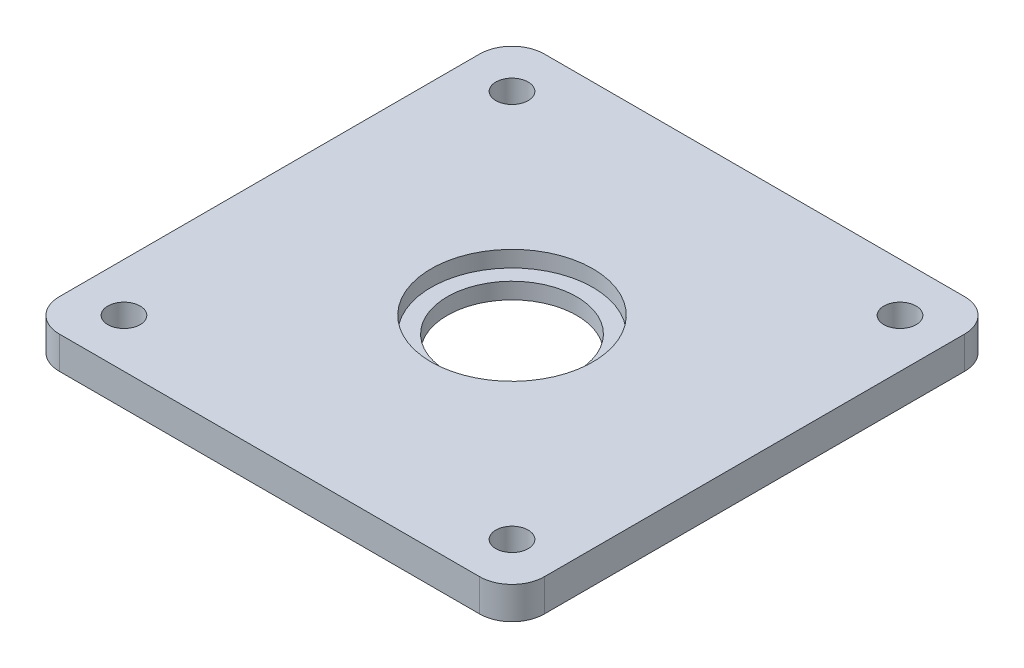
ISO-10303-21;
HEADER;
FILE_DESCRIPTION(('STEP AP214'),'2;1');
FILE_NAME('part.step','',(''),(''),'','','');
FILE_SCHEMA(('AUTOMOTIVE_DESIGN { 1 0 10303 214 1 1 1 1 }'));
ENDSEC;
DATA;
#1=APPLICATION_CONTEXT('core data for automotive mechanical design processes');
#2=APPLICATION_PROTOCOL_DEFINITION('international standard','automotive_design',2000,#1);
#3=PRODUCT_CONTEXT('',#1,'mechanical');
#4=PRODUCT('Part','Part','',(#3));
#5=PRODUCT_RELATED_PRODUCT_CATEGORY('part','',(#4));
#6=PRODUCT_DEFINITION_FORMATION('','',#4);
#7=PRODUCT_DEFINITION_CONTEXT('part definition',#1,'design');
#8=PRODUCT_DEFINITION('design','',#6,#7);
#9=PRODUCT_DEFINITION_SHAPE('','',#8);
#10=(LENGTH_UNIT() NAMED_UNIT(*) SI_UNIT(.MILLI.,.METRE.));
#11=(NAMED_UNIT(*) PLANE_ANGLE_UNIT() SI_UNIT($,.RADIAN.));
#12=(NAMED_UNIT(*) SI_UNIT($,.STERADIAN.) SOLID_ANGLE_UNIT());
#13=UNCERTAINTY_MEASURE_WITH_UNIT(LENGTH_MEASURE(1.E-05),#10,'distance_accuracy_value','');
#14=(GEOMETRIC_REPRESENTATION_CONTEXT(3) GLOBAL_UNCERTAINTY_ASSIGNED_CONTEXT((#13)) GLOBAL_UNIT_ASSIGNED_CONTEXT((#10,
#11,#12)) REPRESENTATION_CONTEXT('',''));
#15=CARTESIAN_POINT('',(0.,0.,0.));
#16=DIRECTION('',(0.,0.,1.));
#17=DIRECTION('',(1.,0.,0.));
#18=AXIS2_PLACEMENT_3D('',#15,#16,#17);
#19=CARTESIAN_POINT('',(0.,5.08,0.));
#20=DIRECTION('',(0.,-1.,0.));
#21=DIRECTION('',(0.,0.,-1.));
#22=AXIS2_PLACEMENT_3D('',#19,#20,#21);
#23=CYLINDRICAL_SURFACE('',#22,10.16);
#24=CARTESIAN_POINT('',(0.,0.,0.));
#25=DIRECTION('',(0.,1.,0.));
#26=DIRECTION('',(0.,0.,1.));
#27=AXIS2_PLACEMENT_3D('',#24,#25,#26);
#28=CIRCLE('',#27,10.16);
#29=CARTESIAN_POINT('',(0.,0.,10.16));
#30=VERTEX_POINT('',#29);
#31=EDGE_CURVE('E135',#30,#30,#28,.T.);
#32=ORIENTED_EDGE('',*,*,#31,.F.);
#33=EDGE_LOOP('',(#32));
#34=FACE_BOUND('',#33,.T.);
#35=CARTESIAN_POINT('',(0.,2.54,0.));
#36=DIRECTION('',(0.,1.,0.));
#37=DIRECTION('',(0.,0.,1.));
#38=AXIS2_PLACEMENT_3D('',#35,#36,#37);
#39=CIRCLE('',#38,10.16);
#40=CARTESIAN_POINT('',(0.,2.54,10.16));
#41=VERTEX_POINT('',#40);
#42=EDGE_CURVE('E36',#41,#41,#39,.T.);
#43=ORIENTED_EDGE('',*,*,#42,.T.);
#44=EDGE_LOOP('',(#43));
#45=FACE_BOUND('',#44,.T.);
#46=ADVANCED_FACE('F32',(#34,#45),#23,.F.);
#47=CARTESIAN_POINT('',(-33.02,5.08,33.02));
#48=DIRECTION('',(0.,-1.,0.));
#49=DIRECTION('',(0.,0.,-1.));
#50=AXIS2_PLACEMENT_3D('',#47,#48,#49);
#51=PLANE('',#50);
#52=CARTESIAN_POINT('',(0.,5.08,0.));
#53=DIRECTION('',(0.,1.,0.));
#54=DIRECTION('',(0.,0.,1.));
#55=AXIS2_PLACEMENT_3D('',#52,#53,#54);
#56=CIRCLE('',#55,12.7);
#57=CARTESIAN_POINT('',(0.,5.08,12.7));
#58=VERTEX_POINT('',#57);
#59=EDGE_CURVE('E207',#58,#58,#56,.T.);
#60=ORIENTED_EDGE('',*,*,#59,.F.);
#61=EDGE_LOOP('',(#60));
#62=FACE_BOUND('',#61,.T.);
#63=CARTESIAN_POINT('',(-33.02,5.08,33.02));
#64=DIRECTION('',(0.,1.,0.));
#65=DIRECTION('',(0.,0.,-1.));
#66=AXIS2_PLACEMENT_3D('',#63,#64,#65);
#67=CIRCLE('',#66,5.08);
#68=CARTESIAN_POINT('',(-38.1,5.08,33.02));
#69=VERTEX_POINT('',#68);
#70=CARTESIAN_POINT('',(-33.02,5.08,38.1));
#71=VERTEX_POINT('',#70);
#72=EDGE_CURVE('E146',#69,#71,#67,.T.);
#73=ORIENTED_EDGE('',*,*,#72,.T.);
#74=DIRECTION('',(1.,0.,0.));
#75=VECTOR('',#74,1.);
#76=CARTESIAN_POINT('',(-33.02,5.08,38.1));
#77=LINE('',#76,#75);
#78=CARTESIAN_POINT('',(33.02,5.08,38.1));
#79=VERTEX_POINT('',#78);
#80=EDGE_CURVE('E93',#71,#79,#77,.T.);
#81=ORIENTED_EDGE('',*,*,#80,.T.);
#82=CARTESIAN_POINT('',(33.02,5.08,33.02));
#83=DIRECTION('',(0.,1.,0.));
#84=DIRECTION('',(0.,0.,1.));
#85=AXIS2_PLACEMENT_3D('',#82,#83,#84);
#86=CIRCLE('',#85,5.08);
#87=CARTESIAN_POINT('',(38.1,5.08,33.02));
#88=VERTEX_POINT('',#87);
#89=EDGE_CURVE('E162',#79,#88,#86,.T.);
#90=ORIENTED_EDGE('',*,*,#89,.T.);
#91=DIRECTION('',(0.,0.,-1.));
#92=VECTOR('',#91,1.);
#93=CARTESIAN_POINT('',(38.1,5.08,33.02));
#94=LINE('',#93,#92);
#95=CARTESIAN_POINT('',(38.1,5.08,-33.02));
#96=VERTEX_POINT('',#95);
#97=EDGE_CURVE('E175',#88,#96,#94,.T.);
#98=ORIENTED_EDGE('',*,*,#97,.T.);
#99=CARTESIAN_POINT('',(33.02,5.08,-33.02));
#100=DIRECTION('',(0.,1.,0.));
#101=DIRECTION('',(0.,0.,-1.));
#102=AXIS2_PLACEMENT_3D('',#99,#100,#101);
#103=CIRCLE('',#102,5.08);
#104=CARTESIAN_POINT('',(33.02,5.08,-38.1));
#105=VERTEX_POINT('',#104);
#106=EDGE_CURVE('E113',#96,#105,#103,.T.);
#107=ORIENTED_EDGE('',*,*,#106,.T.);
#108=DIRECTION('',(-1.,0.,0.));
#109=VECTOR('',#108,1.);
#110=CARTESIAN_POINT('',(-33.02,5.08,-38.1));
#111=LINE('',#110,#109);
#112=CARTESIAN_POINT('',(-33.02,5.08,-38.1));
#113=VERTEX_POINT('',#112);
#114=EDGE_CURVE('E106',#105,#113,#111,.T.);
#115=ORIENTED_EDGE('',*,*,#114,.T.);
#116=CARTESIAN_POINT('',(-33.02,5.08,-33.02));
#117=DIRECTION('',(0.,1.,0.));
#118=DIRECTION('',(0.,0.,-1.));
#119=AXIS2_PLACEMENT_3D('',#116,#117,#118);
#120=CIRCLE('',#119,5.08);
#121=CARTESIAN_POINT('',(-38.1,5.08,-33.02));
#122=VERTEX_POINT('',#121);
#123=EDGE_CURVE('E111',#113,#122,#120,.T.);
#124=ORIENTED_EDGE('',*,*,#123,.T.);
#125=DIRECTION('',(0.,0.,1.));
#126=VECTOR('',#125,1.);
#127=CARTESIAN_POINT('',(-38.1,5.08,33.02));
#128=LINE('',#127,#126);
#129=EDGE_CURVE('E50',#122,#69,#128,.T.);
#130=ORIENTED_EDGE('',*,*,#129,.T.);
#131=EDGE_LOOP('',(#73,#81,#90,#98,#107,#115,#124,#130));
#132=FACE_BOUND('',#131,.T.);
#133=CARTESIAN_POINT('',(-30.48,5.08,-30.48));
#134=DIRECTION('',(0.,1.,0.));
#135=DIRECTION('',(0.,0.,1.));
#136=AXIS2_PLACEMENT_3D('',#133,#134,#135);
#137=CIRCLE('',#136,2.54);
#138=CARTESIAN_POINT('',(-30.48,5.08,-27.94));
#139=VERTEX_POINT('',#138);
#140=EDGE_CURVE('E183',#139,#139,#137,.T.);
#141=ORIENTED_EDGE('',*,*,#140,.F.);
#142=EDGE_LOOP('',(#141));
#143=FACE_BOUND('',#142,.T.);
#144=CARTESIAN_POINT('',(30.48,5.08,30.48));
#145=DIRECTION('',(0.,1.,0.));
#146=DIRECTION('',(0.,0.,1.));
#147=AXIS2_PLACEMENT_3D('',#144,#145,#146);
#148=CIRCLE('',#147,2.54);
#149=CARTESIAN_POINT('',(30.48,5.08,33.02));
#150=VERTEX_POINT('',#149);
#151=EDGE_CURVE('E187',#150,#150,#148,.T.);
#152=ORIENTED_EDGE('',*,*,#151,.F.);
#153=EDGE_LOOP('',(#152));
#154=FACE_BOUND('',#153,.T.);
#155=CARTESIAN_POINT('',(-30.48,5.08,30.48));
#156=DIRECTION('',(0.,1.,0.));
#157=DIRECTION('',(0.,0.,1.));
#158=AXIS2_PLACEMENT_3D('',#155,#156,#157);
#159=CIRCLE('',#158,2.54);
#160=CARTESIAN_POINT('',(-30.48,5.08,33.02));
#161=VERTEX_POINT('',#160);
#162=EDGE_CURVE('E193',#161,#161,#159,.T.);
#163=ORIENTED_EDGE('',*,*,#162,.F.);
#164=EDGE_LOOP('',(#163));
#165=FACE_BOUND('',#164,.T.);
#166=CARTESIAN_POINT('',(30.48,5.08,-30.48));
#167=DIRECTION('',(0.,1.,0.));
#168=DIRECTION('',(0.,0.,1.));
#169=AXIS2_PLACEMENT_3D('',#166,#167,#168);
#170=CIRCLE('',#169,2.54);
#171=CARTESIAN_POINT('',(30.48,5.08,-27.94));
#172=VERTEX_POINT('',#171);
#173=EDGE_CURVE('E199',#172,#172,#170,.T.);
#174=ORIENTED_EDGE('',*,*,#173,.F.);
#175=EDGE_LOOP('',(#174));
#176=FACE_BOUND('',#175,.T.);
#177=ADVANCED_FACE('F108',(#62,#132,#143,#154,#165,#176),#51,.F.);
#178=CARTESIAN_POINT('',(-33.02,0.,33.02));
#179=DIRECTION('',(0.,-1.,0.));
#180=DIRECTION('',(0.,0.,-1.));
#181=AXIS2_PLACEMENT_3D('',#178,#179,#180);
#182=PLANE('',#181);
#183=CARTESIAN_POINT('',(-30.48,0.,30.48));
#184=DIRECTION('',(0.,1.,0.));
#185=DIRECTION('',(0.,0.,1.));
#186=AXIS2_PLACEMENT_3D('',#183,#184,#185);
#187=CIRCLE('',#186,2.54);
#188=CARTESIAN_POINT('',(-30.48,0.,33.02));
#189=VERTEX_POINT('',#188);
#190=EDGE_CURVE('E196',#189,#189,#187,.T.);
#191=ORIENTED_EDGE('',*,*,#190,.T.);
#192=EDGE_LOOP('',(#191));
#193=FACE_BOUND('',#192,.T.);
#194=CARTESIAN_POINT('',(-30.48,0.,-30.48));
#195=DIRECTION('',(0.,1.,0.));
#196=DIRECTION('',(0.,0.,1.));
#197=AXIS2_PLACEMENT_3D('',#194,#195,#196);
#198=CIRCLE('',#197,2.54);
#199=CARTESIAN_POINT('',(-30.48,0.,-27.94));
#200=VERTEX_POINT('',#199);
#201=EDGE_CURVE('E184',#200,#200,#198,.T.);
#202=ORIENTED_EDGE('',*,*,#201,.T.);
#203=EDGE_LOOP('',(#202));
#204=FACE_BOUND('',#203,.T.);
#205=CARTESIAN_POINT('',(-33.02,0.,33.02));
#206=DIRECTION('',(0.,1.,0.));
#207=DIRECTION('',(0.,0.,-1.));
#208=AXIS2_PLACEMENT_3D('',#205,#206,#207);
#209=CIRCLE('',#208,5.08);
#210=CARTESIAN_POINT('',(-38.1,0.,33.02));
#211=VERTEX_POINT('',#210);
#212=CARTESIAN_POINT('',(-33.02,0.,38.1));
#213=VERTEX_POINT('',#212);
#214=EDGE_CURVE('E131',#211,#213,#209,.T.);
#215=ORIENTED_EDGE('',*,*,#214,.F.);
#216=DIRECTION('',(0.,0.,1.));
#217=VECTOR('',#216,1.);
#218=CARTESIAN_POINT('',(-38.1,0.,33.02));
#219=LINE('',#218,#217);
#220=CARTESIAN_POINT('',(-38.1,0.,-33.02));
#221=VERTEX_POINT('',#220);
#222=EDGE_CURVE('E85',#221,#211,#219,.T.);
#223=ORIENTED_EDGE('',*,*,#222,.F.);
#224=CARTESIAN_POINT('',(-33.02,0.,-33.02));
#225=DIRECTION('',(0.,1.,0.));
#226=DIRECTION('',(0.,0.,-1.));
#227=AXIS2_PLACEMENT_3D('',#224,#225,#226);
#228=CIRCLE('',#227,5.08);
#229=CARTESIAN_POINT('',(-33.02,0.,-38.1));
#230=VERTEX_POINT('',#229);
#231=EDGE_CURVE('E79',#230,#221,#228,.T.);
#232=ORIENTED_EDGE('',*,*,#231,.F.);
#233=DIRECTION('',(-1.,0.,0.));
#234=VECTOR('',#233,1.);
#235=CARTESIAN_POINT('',(-33.02,0.,-38.1));
#236=LINE('',#235,#234);
#237=CARTESIAN_POINT('',(33.02,0.,-38.1));
#238=VERTEX_POINT('',#237);
#239=EDGE_CURVE('E121',#238,#230,#236,.T.);
#240=ORIENTED_EDGE('',*,*,#239,.F.);
#241=CARTESIAN_POINT('',(33.02,0.,-33.02));
#242=DIRECTION('',(0.,1.,0.));
#243=DIRECTION('',(0.,0.,-1.));
#244=AXIS2_PLACEMENT_3D('',#241,#242,#243);
#245=CIRCLE('',#244,5.08);
#246=CARTESIAN_POINT('',(38.1,0.,-33.02));
#247=VERTEX_POINT('',#246);
#248=EDGE_CURVE('E141',#247,#238,#245,.T.);
#249=ORIENTED_EDGE('',*,*,#248,.F.);
#250=DIRECTION('',(0.,0.,-1.));
#251=VECTOR('',#250,1.);
#252=CARTESIAN_POINT('',(38.1,0.,33.02));
#253=LINE('',#252,#251);
#254=CARTESIAN_POINT('',(38.1,0.,33.02));
#255=VERTEX_POINT('',#254);
#256=EDGE_CURVE('E139',#255,#247,#253,.T.);
#257=ORIENTED_EDGE('',*,*,#256,.F.);
#258=CARTESIAN_POINT('',(33.02,0.,33.02));
#259=DIRECTION('',(0.,1.,0.));
#260=DIRECTION('',(0.,0.,1.));
#261=AXIS2_PLACEMENT_3D('',#258,#259,#260);
#262=CIRCLE('',#261,5.08);
#263=CARTESIAN_POINT('',(33.02,0.,38.1));
#264=VERTEX_POINT('',#263);
#265=EDGE_CURVE('E137',#264,#255,#262,.T.);
#266=ORIENTED_EDGE('',*,*,#265,.F.);
#267=DIRECTION('',(1.,0.,0.));
#268=VECTOR('',#267,1.);
#269=CARTESIAN_POINT('',(-33.02,0.,38.1));
#270=LINE('',#269,#268);
#271=EDGE_CURVE('E134',#213,#264,#270,.T.);
#272=ORIENTED_EDGE('',*,*,#271,.F.);
#273=EDGE_LOOP('',(#215,#223,#232,#240,#249,#257,#266,#272));
#274=FACE_BOUND('',#273,.T.);
#275=ORIENTED_EDGE('',*,*,#31,.T.);
#276=EDGE_LOOP('',(#275));
#277=FACE_BOUND('',#276,.T.);
#278=CARTESIAN_POINT('',(30.48,0.,30.48));
#279=DIRECTION('',(0.,1.,0.));
#280=DIRECTION('',(0.,0.,1.));
#281=AXIS2_PLACEMENT_3D('',#278,#279,#280);
#282=CIRCLE('',#281,2.54);
#283=CARTESIAN_POINT('',(30.48,0.,33.02));
#284=VERTEX_POINT('',#283);
#285=EDGE_CURVE('E190',#284,#284,#282,.T.);
#286=ORIENTED_EDGE('',*,*,#285,.T.);
#287=EDGE_LOOP('',(#286));
#288=FACE_BOUND('',#287,.T.);
#289=CARTESIAN_POINT('',(30.48,0.,-30.48));
#290=DIRECTION('',(0.,1.,0.));
#291=DIRECTION('',(0.,0.,1.));
#292=AXIS2_PLACEMENT_3D('',#289,#290,#291);
#293=CIRCLE('',#292,2.54);
#294=CARTESIAN_POINT('',(30.48,0.,-27.94));
#295=VERTEX_POINT('',#294);
#296=EDGE_CURVE('E202',#295,#295,#293,.T.);
#297=ORIENTED_EDGE('',*,*,#296,.T.);
#298=EDGE_LOOP('',(#297));
#299=FACE_BOUND('',#298,.T.);
#300=ADVANCED_FACE('F166',(#193,#204,#274,#277,#288,#299),#182,.T.);
#301=CARTESIAN_POINT('',(-33.02,5.08,33.02));
#302=DIRECTION('',(0.,-1.,0.));
#303=DIRECTION('',(0.,0.,-1.));
#304=AXIS2_PLACEMENT_3D('',#301,#302,#303);
#305=CYLINDRICAL_SURFACE('',#304,5.08);
#306=ORIENTED_EDGE('',*,*,#214,.T.);
#307=DIRECTION('',(0.,-1.,0.));
#308=VECTOR('',#307,1.);
#309=CARTESIAN_POINT('',(-33.02,5.08,38.1));
#310=LINE('',#309,#308);
#311=EDGE_CURVE('E11',#71,#213,#310,.T.);
#312=ORIENTED_EDGE('',*,*,#311,.F.);
#313=ORIENTED_EDGE('',*,*,#72,.F.);
#314=DIRECTION('',(0.,-1.,0.));
#315=VECTOR('',#314,1.);
#316=CARTESIAN_POINT('',(-38.1,5.08,33.02));
#317=LINE('',#316,#315);
#318=EDGE_CURVE('E127',#69,#211,#317,.T.);
#319=ORIENTED_EDGE('',*,*,#318,.T.);
#320=EDGE_LOOP('',(#306,#312,#313,#319));
#321=FACE_BOUND('',#320,.T.);
#322=ADVANCED_FACE('F34',(#321),#305,.T.);
#323=CARTESIAN_POINT('',(-33.02,5.08,38.1));
#324=DIRECTION('',(0.,0.,-1.));
#325=DIRECTION('',(-1.,0.,0.));
#326=AXIS2_PLACEMENT_3D('',#323,#324,#325);
#327=PLANE('',#326);
#328=ORIENTED_EDGE('',*,*,#271,.T.);
#329=DIRECTION('',(0.,-1.,0.));
#330=VECTOR('',#329,1.);
#331=CARTESIAN_POINT('',(33.02,5.08,38.1));
#332=LINE('',#331,#330);
#333=EDGE_CURVE('E42',#79,#264,#332,.T.);
#334=ORIENTED_EDGE('',*,*,#333,.F.);
#335=ORIENTED_EDGE('',*,*,#80,.F.);
#336=ORIENTED_EDGE('',*,*,#311,.T.);
#337=EDGE_LOOP('',(#328,#334,#335,#336));
#338=FACE_BOUND('',#337,.T.);
#339=ADVANCED_FACE('F256',(#338),#327,.F.);
#340=CARTESIAN_POINT('',(33.02,5.08,33.02));
#341=DIRECTION('',(0.,-1.,0.));
#342=DIRECTION('',(0.,0.,-1.));
#343=AXIS2_PLACEMENT_3D('',#340,#341,#342);
#344=CYLINDRICAL_SURFACE('',#343,5.08);
#345=ORIENTED_EDGE('',*,*,#265,.T.);
#346=DIRECTION('',(0.,-1.,0.));
#347=VECTOR('',#346,1.);
#348=CARTESIAN_POINT('',(38.1,5.08,33.02));
#349=LINE('',#348,#347);
#350=EDGE_CURVE('E153',#88,#255,#349,.T.);
#351=ORIENTED_EDGE('',*,*,#350,.F.);
#352=ORIENTED_EDGE('',*,*,#89,.F.);
#353=ORIENTED_EDGE('',*,*,#333,.T.);
#354=EDGE_LOOP('',(#345,#351,#352,#353));
#355=FACE_BOUND('',#354,.T.);
#356=ADVANCED_FACE('F160',(#355),#344,.T.);
#357=CARTESIAN_POINT('',(38.1,5.08,33.02));
#358=DIRECTION('',(-1.,0.,0.));
#359=DIRECTION('',(0.,0.,1.));
#360=AXIS2_PLACEMENT_3D('',#357,#358,#359);
#361=PLANE('',#360);
#362=ORIENTED_EDGE('',*,*,#256,.T.);
#363=DIRECTION('',(0.,-1.,0.));
#364=VECTOR('',#363,1.);
#365=CARTESIAN_POINT('',(38.1,5.08,-33.02));
#366=LINE('',#365,#364);
#367=EDGE_CURVE('E150',#96,#247,#366,.T.);
#368=ORIENTED_EDGE('',*,*,#367,.F.);
#369=ORIENTED_EDGE('',*,*,#97,.F.);
#370=ORIENTED_EDGE('',*,*,#350,.T.);
#371=EDGE_LOOP('',(#362,#368,#369,#370));
#372=FACE_BOUND('',#371,.T.);
#373=ADVANCED_FACE('F171',(#372),#361,.F.);
#374=CARTESIAN_POINT('',(33.02,5.08,-33.02));
#375=DIRECTION('',(0.,-1.,0.));
#376=DIRECTION('',(0.,0.,-1.));
#377=AXIS2_PLACEMENT_3D('',#374,#375,#376);
#378=CYLINDRICAL_SURFACE('',#377,5.08);
#379=ORIENTED_EDGE('',*,*,#248,.T.);
#380=DIRECTION('',(0.,-1.,0.));
#381=VECTOR('',#380,1.);
#382=CARTESIAN_POINT('',(33.02,5.08,-38.1));
#383=LINE('',#382,#381);
#384=EDGE_CURVE('E122',#105,#238,#383,.T.);
#385=ORIENTED_EDGE('',*,*,#384,.F.);
#386=ORIENTED_EDGE('',*,*,#106,.F.);
#387=ORIENTED_EDGE('',*,*,#367,.T.);
#388=EDGE_LOOP('',(#379,#385,#386,#387));
#389=FACE_BOUND('',#388,.T.);
#390=ADVANCED_FACE('F174',(#389),#378,.T.);
#391=CARTESIAN_POINT('',(-33.02,5.08,-38.1));
#392=DIRECTION('',(0.,0.,1.));
#393=DIRECTION('',(1.,0.,0.));
#394=AXIS2_PLACEMENT_3D('',#391,#392,#393);
#395=PLANE('',#394);
#396=ORIENTED_EDGE('',*,*,#239,.T.);
#397=DIRECTION('',(0.,-1.,0.));
#398=VECTOR('',#397,1.);
#399=CARTESIAN_POINT('',(-33.02,5.08,-38.1));
#400=LINE('',#399,#398);
#401=EDGE_CURVE('E118',#113,#230,#400,.T.);
#402=ORIENTED_EDGE('',*,*,#401,.F.);
#403=ORIENTED_EDGE('',*,*,#114,.F.);
#404=ORIENTED_EDGE('',*,*,#384,.T.);
#405=EDGE_LOOP('',(#396,#402,#403,#404));
#406=FACE_BOUND('',#405,.T.);
#407=ADVANCED_FACE('F119',(#406),#395,.F.);
#408=CARTESIAN_POINT('',(-33.02,5.08,-33.02));
#409=DIRECTION('',(0.,-1.,0.));
#410=DIRECTION('',(0.,0.,-1.));
#411=AXIS2_PLACEMENT_3D('',#408,#409,#410);
#412=CYLINDRICAL_SURFACE('',#411,5.08);
#413=ORIENTED_EDGE('',*,*,#231,.T.);
#414=DIRECTION('',(0.,-1.,0.));
#415=VECTOR('',#414,1.);
#416=CARTESIAN_POINT('',(-38.1,5.08,-33.02));
#417=LINE('',#416,#415);
#418=EDGE_CURVE('E123',#122,#221,#417,.T.);
#419=ORIENTED_EDGE('',*,*,#418,.F.);
#420=ORIENTED_EDGE('',*,*,#123,.F.);
#421=ORIENTED_EDGE('',*,*,#401,.T.);
#422=EDGE_LOOP('',(#413,#419,#420,#421));
#423=FACE_BOUND('',#422,.T.);
#424=ADVANCED_FACE('F125',(#423),#412,.T.);
#425=CARTESIAN_POINT('',(-38.1,5.08,33.02));
#426=DIRECTION('',(1.,0.,0.));
#427=DIRECTION('',(0.,0.,-1.));
#428=AXIS2_PLACEMENT_3D('',#425,#426,#427);
#429=PLANE('',#428);
#430=ORIENTED_EDGE('',*,*,#222,.T.);
#431=ORIENTED_EDGE('',*,*,#318,.F.);
#432=ORIENTED_EDGE('',*,*,#129,.F.);
#433=ORIENTED_EDGE('',*,*,#418,.T.);
#434=EDGE_LOOP('',(#430,#431,#432,#433));
#435=FACE_BOUND('',#434,.T.);
#436=ADVANCED_FACE('F244',(#435),#429,.F.);
#437=CARTESIAN_POINT('',(-30.48,5.08,-30.48));
#438=DIRECTION('',(0.,-1.,0.));
#439=DIRECTION('',(0.,0.,-1.));
#440=AXIS2_PLACEMENT_3D('',#437,#438,#439);
#441=CYLINDRICAL_SURFACE('',#440,2.54);
#442=ORIENTED_EDGE('',*,*,#140,.T.);
#443=EDGE_LOOP('',(#442));
#444=FACE_BOUND('',#443,.T.);
#445=ORIENTED_EDGE('',*,*,#201,.F.);
#446=EDGE_LOOP('',(#445));
#447=FACE_BOUND('',#446,.T.);
#448=ADVANCED_FACE('F238',(#444,#447),#441,.F.);
#449=CARTESIAN_POINT('',(30.48,5.08,30.48));
#450=DIRECTION('',(0.,-1.,0.));
#451=DIRECTION('',(0.,0.,-1.));
#452=AXIS2_PLACEMENT_3D('',#449,#450,#451);
#453=CYLINDRICAL_SURFACE('',#452,2.54);
#454=ORIENTED_EDGE('',*,*,#151,.T.);
#455=EDGE_LOOP('',(#454));
#456=FACE_BOUND('',#455,.T.);
#457=ORIENTED_EDGE('',*,*,#285,.F.);
#458=EDGE_LOOP('',(#457));
#459=FACE_BOUND('',#458,.T.);
#460=ADVANCED_FACE('F302',(#456,#459),#453,.F.);
#461=CARTESIAN_POINT('',(-30.48,5.08,30.48));
#462=DIRECTION('',(0.,-1.,0.));
#463=DIRECTION('',(0.,0.,-1.));
#464=AXIS2_PLACEMENT_3D('',#461,#462,#463);
#465=CYLINDRICAL_SURFACE('',#464,2.54);
#466=ORIENTED_EDGE('',*,*,#162,.T.);
#467=EDGE_LOOP('',(#466));
#468=FACE_BOUND('',#467,.T.);
#469=ORIENTED_EDGE('',*,*,#190,.F.);
#470=EDGE_LOOP('',(#469));
#471=FACE_BOUND('',#470,.T.);
#472=ADVANCED_FACE('F294',(#468,#471),#465,.F.);
#473=CARTESIAN_POINT('',(30.48,5.08,-30.48));
#474=DIRECTION('',(0.,-1.,0.));
#475=DIRECTION('',(0.,0.,-1.));
#476=AXIS2_PLACEMENT_3D('',#473,#474,#475);
#477=CYLINDRICAL_SURFACE('',#476,2.54);
#478=ORIENTED_EDGE('',*,*,#173,.T.);
#479=EDGE_LOOP('',(#478));
#480=FACE_BOUND('',#479,.T.);
#481=ORIENTED_EDGE('',*,*,#296,.F.);
#482=EDGE_LOOP('',(#481));
#483=FACE_BOUND('',#482,.T.);
#484=ADVANCED_FACE('F225',(#480,#483),#477,.F.);
#485=CARTESIAN_POINT('',(0.,2.54,0.));
#486=DIRECTION('',(0.,1.,0.));
#487=DIRECTION('',(0.,0.,1.));
#488=AXIS2_PLACEMENT_3D('',#485,#486,#487);
#489=CYLINDRICAL_SURFACE('',#488,12.7);
#490=CARTESIAN_POINT('',(0.,2.54,0.));
#491=DIRECTION('',(0.,1.,0.));
#492=DIRECTION('',(0.,0.,1.));
#493=AXIS2_PLACEMENT_3D('',#490,#491,#492);
#494=CIRCLE('',#493,12.7);
#495=CARTESIAN_POINT('',(0.,2.54,12.7));
#496=VERTEX_POINT('',#495);
#497=EDGE_CURVE('E210',#496,#496,#494,.T.);
#498=ORIENTED_EDGE('',*,*,#497,.F.);
#499=EDGE_LOOP('',(#498));
#500=FACE_BOUND('',#499,.T.);
#501=ORIENTED_EDGE('',*,*,#59,.T.);
#502=EDGE_LOOP('',(#501));
#503=FACE_BOUND('',#502,.T.);
#504=ADVANCED_FACE('F220',(#500,#503),#489,.F.);
#505=CARTESIAN_POINT('',(0.,2.54,0.));
#506=DIRECTION('',(0.,1.,0.));
#507=DIRECTION('',(0.,0.,1.));
#508=AXIS2_PLACEMENT_3D('',#505,#506,#507);
#509=PLANE('',#508);
#510=ORIENTED_EDGE('',*,*,#42,.F.);
#511=EDGE_LOOP('',(#510));
#512=FACE_BOUND('',#511,.T.);
#513=ORIENTED_EDGE('',*,*,#497,.T.);
#514=EDGE_LOOP('',(#513));
#515=FACE_BOUND('',#514,.T.);
#516=ADVANCED_FACE('F218',(#512,#515),#509,.T.);
#517=CLOSED_SHELL('',(#46,#177,#300,#322,#339,#356,#373,#390,#407,#424,#436,#448,#460,#472,#484,
#504,#516));
#518=MANIFOLD_SOLID_BREP('B2',#517);
#519=ADVANCED_BREP_SHAPE_REPRESENTATION('',(#18,#518),#14);
#520=SHAPE_DEFINITION_REPRESENTATION(#9,#519);
ENDSEC;
END-ISO-10303-21;
